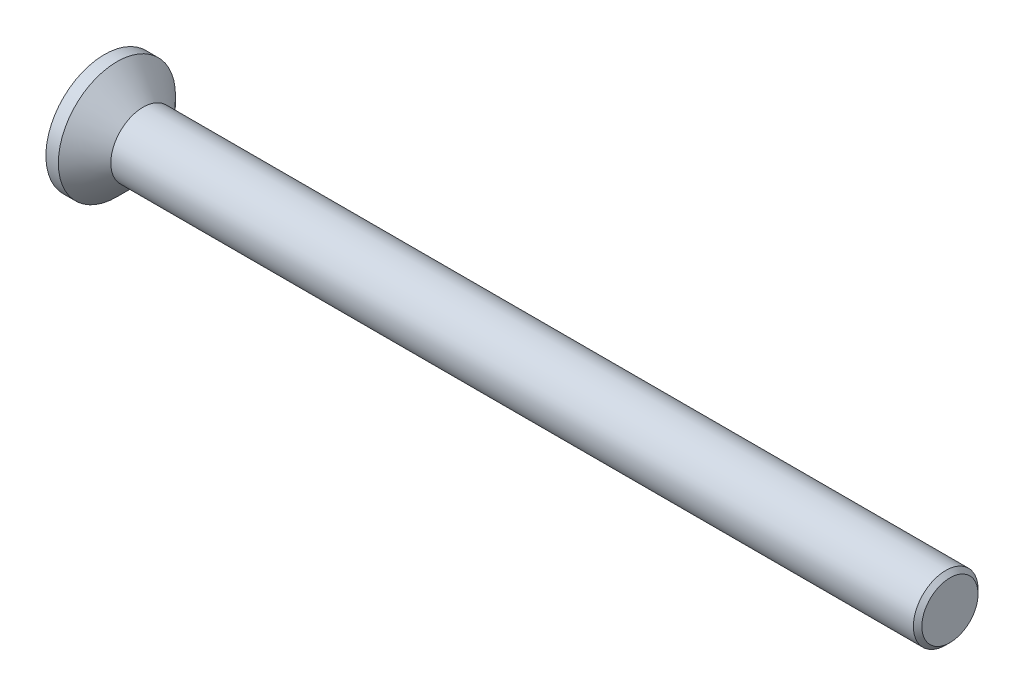
ISO-10303-21;
HEADER;
FILE_DESCRIPTION(('STEP AP214'),'2;1');
FILE_NAME('part.step','',(''),(''),'','','');
FILE_SCHEMA(('AUTOMOTIVE_DESIGN { 1 0 10303 214 1 1 1 1 }'));
ENDSEC;
DATA;
#1=APPLICATION_CONTEXT('core data for automotive mechanical design processes');
#2=APPLICATION_PROTOCOL_DEFINITION('international standard','automotive_design',2000,#1);
#3=PRODUCT_CONTEXT('',#1,'mechanical');
#4=PRODUCT('Part','Part','',(#3));
#5=PRODUCT_RELATED_PRODUCT_CATEGORY('part','',(#4));
#6=PRODUCT_DEFINITION_FORMATION('','',#4);
#7=PRODUCT_DEFINITION_CONTEXT('part definition',#1,'design');
#8=PRODUCT_DEFINITION('design','',#6,#7);
#9=PRODUCT_DEFINITION_SHAPE('','',#8);
#10=(LENGTH_UNIT() NAMED_UNIT(*) SI_UNIT(.MILLI.,.METRE.));
#11=(NAMED_UNIT(*) PLANE_ANGLE_UNIT() SI_UNIT($,.RADIAN.));
#12=(NAMED_UNIT(*) SI_UNIT($,.STERADIAN.) SOLID_ANGLE_UNIT());
#13=UNCERTAINTY_MEASURE_WITH_UNIT(LENGTH_MEASURE(1.E-05),#10,'distance_accuracy_value','');
#14=(GEOMETRIC_REPRESENTATION_CONTEXT(3) GLOBAL_UNCERTAINTY_ASSIGNED_CONTEXT((#13)) GLOBAL_UNIT_ASSIGNED_CONTEXT((#10,
#11,#12)) REPRESENTATION_CONTEXT('',''));
#15=CARTESIAN_POINT('',(0.,0.,0.));
#16=DIRECTION('',(0.,0.,1.));
#17=DIRECTION('',(1.,0.,0.));
#18=AXIS2_PLACEMENT_3D('',#15,#16,#17);
#19=CARTESIAN_POINT('',(1.09999999999999,0.,0.));
#20=DIRECTION('',(-1.,0.,0.));
#21=DIRECTION('',(0.,0.,1.));
#22=AXIS2_PLACEMENT_3D('',#19,#20,#21);
#23=CONICAL_SURFACE('',#22,0.99999999999989,1.04719755119658);
#24=CARTESIAN_POINT('',(1.67735026918958,0.,0.));
#25=VERTEX_POINT('',#24);
#26=VERTEX_LOOP('',#25);
#27=FACE_BOUND('',#26,.T.);
#28=CARTESIAN_POINT('',(1.09999999999999,0.,0.));
#29=DIRECTION('',(-1.,0.,0.));
#30=DIRECTION('',(0.,0.,1.));
#31=AXIS2_PLACEMENT_3D('',#28,#29,#30);
#32=CIRCLE('',#31,0.99999999999989);
#33=CARTESIAN_POINT('',(1.09999999999999,-0.499999999999972,0.86602540378439));
#34=VERTEX_POINT('',#33);
#35=CARTESIAN_POINT('',(1.09999999999999,0.499999999999972,0.866025403784391));
#36=VERTEX_POINT('',#35);
#37=EDGE_CURVE('E91',#34,#36,#32,.T.);
#38=ORIENTED_EDGE('',*,*,#37,.T.);
#39=CARTESIAN_POINT('',(1.09999999999999,0.,0.));
#40=DIRECTION('',(-1.,0.,0.));
#41=DIRECTION('',(0.,0.,1.));
#42=AXIS2_PLACEMENT_3D('',#39,#40,#41);
#43=CIRCLE('',#42,0.99999999999989);
#44=CARTESIAN_POINT('',(1.09999999999999,0.999999999999945,0.));
#45=VERTEX_POINT('',#44);
#46=EDGE_CURVE('E105',#36,#45,#43,.T.);
#47=ORIENTED_EDGE('',*,*,#46,.T.);
#48=CARTESIAN_POINT('',(1.09999999999999,0.,0.));
#49=DIRECTION('',(-1.,0.,0.));
#50=DIRECTION('',(0.,0.,1.));
#51=AXIS2_PLACEMENT_3D('',#48,#49,#50);
#52=CIRCLE('',#51,0.99999999999989);
#53=CARTESIAN_POINT('',(1.09999999999999,0.499999999999972,-0.866025403784391));
#54=VERTEX_POINT('',#53);
#55=EDGE_CURVE('E148',#45,#54,#52,.T.);
#56=ORIENTED_EDGE('',*,*,#55,.T.);
#57=CARTESIAN_POINT('',(1.09999999999999,0.,0.));
#58=DIRECTION('',(-1.,0.,0.));
#59=DIRECTION('',(0.,0.,1.));
#60=AXIS2_PLACEMENT_3D('',#57,#58,#59);
#61=CIRCLE('',#60,0.99999999999989);
#62=CARTESIAN_POINT('',(1.09999999999999,-0.499999999999973,-0.866025403784392));
#63=VERTEX_POINT('',#62);
#64=EDGE_CURVE('E135',#54,#63,#61,.T.);
#65=ORIENTED_EDGE('',*,*,#64,.T.);
#66=CARTESIAN_POINT('',(1.09999999999999,0.,0.));
#67=DIRECTION('',(-1.,0.,0.));
#68=DIRECTION('',(0.,0.,1.));
#69=AXIS2_PLACEMENT_3D('',#66,#67,#68);
#70=CIRCLE('',#69,0.99999999999989);
#71=CARTESIAN_POINT('',(1.09999999999999,-0.999999999999945,0.));
#72=VERTEX_POINT('',#71);
#73=EDGE_CURVE('E88',#63,#72,#70,.T.);
#74=ORIENTED_EDGE('',*,*,#73,.T.);
#75=CARTESIAN_POINT('',(1.09999999999999,0.,0.));
#76=DIRECTION('',(-1.,0.,0.));
#77=DIRECTION('',(0.,0.,1.));
#78=AXIS2_PLACEMENT_3D('',#75,#76,#77);
#79=CIRCLE('',#78,0.99999999999989);
#80=EDGE_CURVE('E19',#72,#34,#79,.T.);
#81=ORIENTED_EDGE('',*,*,#80,.T.);
#82=EDGE_LOOP('',(#38,#47,#56,#65,#74,#81));
#83=FACE_BOUND('',#82,.T.);
#84=ADVANCED_FACE('F16',(#27,#83),#23,.F.);
#85=CARTESIAN_POINT('',(1.1,0.,-1.15470053837925));
#86=DIRECTION('',(1.,0.,0.));
#87=DIRECTION('',(0.,0.,-1.));
#88=AXIS2_PLACEMENT_3D('',#85,#86,#87);
#89=PLANE('',#88);
#90=DIRECTION('',(0.,0.,1.));
#91=VECTOR('',#90,1.);
#92=CARTESIAN_POINT('',(1.1,-1.,0.577350269189625));
#93=LINE('',#92,#91);
#94=CARTESIAN_POINT('',(1.1,-1.,0.577350269189624));
#95=VERTEX_POINT('',#94);
#96=EDGE_CURVE('E110',#95,#72,#93,.F.);
#97=ORIENTED_EDGE('',*,*,#96,.F.);
#98=DIRECTION('',(0.,0.866025403784439,0.5));
#99=VECTOR('',#98,1.);
#100=CARTESIAN_POINT('',(1.1,0.,1.15470053837925));
#101=LINE('',#100,#99);
#102=EDGE_CURVE('E107',#34,#95,#101,.F.);
#103=ORIENTED_EDGE('',*,*,#102,.F.);
#104=ORIENTED_EDGE('',*,*,#80,.F.);
#105=EDGE_LOOP('',(#97,#103,#104));
#106=FACE_BOUND('',#105,.T.);
#107=ADVANCED_FACE('F108',(#106),#89,.F.);
#108=CARTESIAN_POINT('',(1.1,0.,-1.15470053837925));
#109=DIRECTION('',(1.,0.,0.));
#110=DIRECTION('',(0.,0.,-1.));
#111=AXIS2_PLACEMENT_3D('',#108,#109,#110);
#112=PLANE('',#111);
#113=DIRECTION('',(0.,0.866025403784439,0.5));
#114=VECTOR('',#113,1.);
#115=CARTESIAN_POINT('',(1.1,0.,1.15470053837925));
#116=LINE('',#115,#114);
#117=CARTESIAN_POINT('',(1.1,0.,1.15470053837925));
#118=VERTEX_POINT('',#117);
#119=EDGE_CURVE('E100',#118,#34,#116,.F.);
#120=ORIENTED_EDGE('',*,*,#119,.F.);
#121=DIRECTION('',(0.,0.866025403784439,-0.5));
#122=VECTOR('',#121,1.);
#123=CARTESIAN_POINT('',(1.1,1.,0.577350269189625));
#124=LINE('',#123,#122);
#125=EDGE_CURVE('E103',#36,#118,#124,.F.);
#126=ORIENTED_EDGE('',*,*,#125,.F.);
#127=ORIENTED_EDGE('',*,*,#37,.F.);
#128=EDGE_LOOP('',(#120,#126,#127));
#129=FACE_BOUND('',#128,.T.);
#130=ADVANCED_FACE('F98',(#129),#112,.F.);
#131=CARTESIAN_POINT('',(1.1,0.,-1.15470053837925));
#132=DIRECTION('',(1.,0.,0.));
#133=DIRECTION('',(0.,0.,-1.));
#134=AXIS2_PLACEMENT_3D('',#131,#132,#133);
#135=PLANE('',#134);
#136=DIRECTION('',(0.,0.866025403784439,-0.5));
#137=VECTOR('',#136,1.);
#138=CARTESIAN_POINT('',(1.1,1.,0.577350269189625));
#139=LINE('',#138,#137);
#140=CARTESIAN_POINT('',(1.1,1.,0.577350269189625));
#141=VERTEX_POINT('',#140);
#142=EDGE_CURVE('E131',#141,#36,#139,.F.);
#143=ORIENTED_EDGE('',*,*,#142,.F.);
#144=DIRECTION('',(0.,0.,-1.));
#145=VECTOR('',#144,1.);
#146=CARTESIAN_POINT('',(1.1,1.,-0.577350269189625));
#147=LINE('',#146,#145);
#148=EDGE_CURVE('E164',#45,#141,#147,.F.);
#149=ORIENTED_EDGE('',*,*,#148,.F.);
#150=ORIENTED_EDGE('',*,*,#46,.F.);
#151=EDGE_LOOP('',(#143,#149,#150));
#152=FACE_BOUND('',#151,.T.);
#153=ADVANCED_FACE('F165',(#152),#135,.F.);
#154=CARTESIAN_POINT('',(1.1,0.,-1.15470053837925));
#155=DIRECTION('',(1.,0.,0.));
#156=DIRECTION('',(0.,0.,-1.));
#157=AXIS2_PLACEMENT_3D('',#154,#155,#156);
#158=PLANE('',#157);
#159=DIRECTION('',(0.,0.,-1.));
#160=VECTOR('',#159,1.);
#161=CARTESIAN_POINT('',(1.1,1.,-0.577350269189625));
#162=LINE('',#161,#160);
#163=CARTESIAN_POINT('',(1.1,1.,-0.577350269189625));
#164=VERTEX_POINT('',#163);
#165=EDGE_CURVE('E158',#164,#45,#162,.F.);
#166=ORIENTED_EDGE('',*,*,#165,.F.);
#167=DIRECTION('',(0.,-0.866025403784439,-0.5));
#168=VECTOR('',#167,1.);
#169=CARTESIAN_POINT('',(1.1,0.,-1.15470053837925));
#170=LINE('',#169,#168);
#171=EDGE_CURVE('E161',#54,#164,#170,.F.);
#172=ORIENTED_EDGE('',*,*,#171,.F.);
#173=ORIENTED_EDGE('',*,*,#55,.F.);
#174=EDGE_LOOP('',(#166,#172,#173));
#175=FACE_BOUND('',#174,.T.);
#176=ADVANCED_FACE('F156',(#175),#158,.F.);
#177=CARTESIAN_POINT('',(1.1,0.,-1.15470053837925));
#178=DIRECTION('',(1.,0.,0.));
#179=DIRECTION('',(0.,0.,-1.));
#180=AXIS2_PLACEMENT_3D('',#177,#178,#179);
#181=PLANE('',#180);
#182=DIRECTION('',(0.,-0.866025403784439,0.5));
#183=VECTOR('',#182,1.);
#184=CARTESIAN_POINT('',(1.1,-1.,-0.577350269189628));
#185=LINE('',#184,#183);
#186=CARTESIAN_POINT('',(1.1,-1.,-0.577350269189628));
#187=VERTEX_POINT('',#186);
#188=EDGE_CURVE('E210',#187,#63,#185,.F.);
#189=ORIENTED_EDGE('',*,*,#188,.F.);
#190=DIRECTION('',(0.,0.,1.));
#191=VECTOR('',#190,1.);
#192=CARTESIAN_POINT('',(1.1,-1.,0.577350269189625));
#193=LINE('',#192,#191);
#194=EDGE_CURVE('E119',#72,#187,#193,.F.);
#195=ORIENTED_EDGE('',*,*,#194,.F.);
#196=ORIENTED_EDGE('',*,*,#73,.F.);
#197=EDGE_LOOP('',(#189,#195,#196));
#198=FACE_BOUND('',#197,.T.);
#199=ADVANCED_FACE('F249',(#198),#181,.F.);
#200=CARTESIAN_POINT('',(1.1,0.,-1.15470053837925));
#201=DIRECTION('',(1.,0.,0.));
#202=DIRECTION('',(0.,0.,-1.));
#203=AXIS2_PLACEMENT_3D('',#200,#201,#202);
#204=PLANE('',#203);
#205=DIRECTION('',(0.,-0.866025403784439,-0.5));
#206=VECTOR('',#205,1.);
#207=CARTESIAN_POINT('',(1.1,0.,-1.15470053837925));
#208=LINE('',#207,#206);
#209=CARTESIAN_POINT('',(1.1,0.,-1.15470053837925));
#210=VERTEX_POINT('',#209);
#211=EDGE_CURVE('E183',#210,#54,#208,.F.);
#212=ORIENTED_EDGE('',*,*,#211,.F.);
#213=DIRECTION('',(0.,-0.866025403784439,0.5));
#214=VECTOR('',#213,1.);
#215=CARTESIAN_POINT('',(1.1,-1.,-0.577350269189628));
#216=LINE('',#215,#214);
#217=EDGE_CURVE('E213',#63,#210,#216,.F.);
#218=ORIENTED_EDGE('',*,*,#217,.F.);
#219=ORIENTED_EDGE('',*,*,#64,.F.);
#220=EDGE_LOOP('',(#212,#218,#219));
#221=FACE_BOUND('',#220,.T.);
#222=ADVANCED_FACE('F246',(#221),#204,.F.);
#223=CARTESIAN_POINT('',(1.1,-1.,0.577350269189625));
#224=DIRECTION('',(0.,1.,0.));
#225=DIRECTION('',(0.,0.,1.));
#226=AXIS2_PLACEMENT_3D('',#223,#224,#225);
#227=PLANE('',#226);
#228=ORIENTED_EDGE('',*,*,#194,.T.);
#229=DIRECTION('',(1.,0.,0.));
#230=VECTOR('',#229,1.);
#231=CARTESIAN_POINT('',(1.1,-1.,-0.577350269189628));
#232=LINE('',#231,#230);
#233=CARTESIAN_POINT('',(0.,-1.,-0.577350269189628));
#234=VERTEX_POINT('',#233);
#235=EDGE_CURVE('E214',#234,#187,#232,.T.);
#236=ORIENTED_EDGE('',*,*,#235,.F.);
#237=DIRECTION('',(0.,0.,-1.));
#238=VECTOR('',#237,1.);
#239=CARTESIAN_POINT('',(0.,-1.,0.));
#240=LINE('',#239,#238);
#241=CARTESIAN_POINT('',(0.,-1.,0.577350269189625));
#242=VERTEX_POINT('',#241);
#243=EDGE_CURVE('E209',#234,#242,#240,.F.);
#244=ORIENTED_EDGE('',*,*,#243,.T.);
#245=DIRECTION('',(1.,0.,0.));
#246=VECTOR('',#245,1.);
#247=CARTESIAN_POINT('',(1.1,-1.,0.577350269189624));
#248=LINE('',#247,#246);
#249=EDGE_CURVE('E114',#95,#242,#248,.F.);
#250=ORIENTED_EDGE('',*,*,#249,.F.);
#251=ORIENTED_EDGE('',*,*,#96,.T.);
#252=EDGE_LOOP('',(#228,#236,#244,#250,#251));
#253=FACE_BOUND('',#252,.T.);
#254=ADVANCED_FACE('F251',(#253),#227,.T.);
#255=CARTESIAN_POINT('',(1.1,0.,1.15470053837925));
#256=DIRECTION('',(0.,0.5,-0.866025403784439));
#257=DIRECTION('',(0.,0.866025403784439,0.5));
#258=AXIS2_PLACEMENT_3D('',#255,#256,#257);
#259=PLANE('',#258);
#260=ORIENTED_EDGE('',*,*,#102,.T.);
#261=ORIENTED_EDGE('',*,*,#249,.T.);
#262=DIRECTION('',(0.,0.866025403784439,0.499999999999999));
#263=VECTOR('',#262,1.);
#264=CARTESIAN_POINT('',(0.,-1.,0.577350269189625));
#265=LINE('',#264,#263);
#266=CARTESIAN_POINT('',(0.,0.,1.15470053837925));
#267=VERTEX_POINT('',#266);
#268=EDGE_CURVE('E204',#242,#267,#265,.T.);
#269=ORIENTED_EDGE('',*,*,#268,.T.);
#270=DIRECTION('',(1.,0.,0.));
#271=VECTOR('',#270,1.);
#272=CARTESIAN_POINT('',(1.1,0.,1.15470053837925));
#273=LINE('',#272,#271);
#274=EDGE_CURVE('E118',#118,#267,#273,.F.);
#275=ORIENTED_EDGE('',*,*,#274,.F.);
#276=ORIENTED_EDGE('',*,*,#119,.T.);
#277=EDGE_LOOP('',(#260,#261,#269,#275,#276));
#278=FACE_BOUND('',#277,.T.);
#279=ADVANCED_FACE('F116',(#278),#259,.T.);
#280=CARTESIAN_POINT('',(1.1,1.,0.577350269189625));
#281=DIRECTION('',(0.,-0.5,-0.866025403784439));
#282=DIRECTION('',(0.,0.866025403784439,-0.5));
#283=AXIS2_PLACEMENT_3D('',#280,#281,#282);
#284=PLANE('',#283);
#285=ORIENTED_EDGE('',*,*,#125,.T.);
#286=ORIENTED_EDGE('',*,*,#274,.T.);
#287=DIRECTION('',(0.,0.866025403784439,-0.5));
#288=VECTOR('',#287,1.);
#289=CARTESIAN_POINT('',(0.,0.,1.15470053837925));
#290=LINE('',#289,#288);
#291=CARTESIAN_POINT('',(0.,1.,0.577350269189625));
#292=VERTEX_POINT('',#291);
#293=EDGE_CURVE('E194',#267,#292,#290,.T.);
#294=ORIENTED_EDGE('',*,*,#293,.T.);
#295=DIRECTION('',(1.,0.,0.));
#296=VECTOR('',#295,1.);
#297=CARTESIAN_POINT('',(1.1,1.,0.577350269189625));
#298=LINE('',#297,#296);
#299=EDGE_CURVE('E169',#141,#292,#298,.F.);
#300=ORIENTED_EDGE('',*,*,#299,.F.);
#301=ORIENTED_EDGE('',*,*,#142,.T.);
#302=EDGE_LOOP('',(#285,#286,#294,#300,#301));
#303=FACE_BOUND('',#302,.T.);
#304=ADVANCED_FACE('F192',(#303),#284,.T.);
#305=CARTESIAN_POINT('',(1.1,1.,-0.577350269189625));
#306=DIRECTION('',(0.,-1.,0.));
#307=DIRECTION('',(0.,0.,-1.));
#308=AXIS2_PLACEMENT_3D('',#305,#306,#307);
#309=PLANE('',#308);
#310=ORIENTED_EDGE('',*,*,#148,.T.);
#311=ORIENTED_EDGE('',*,*,#299,.T.);
#312=DIRECTION('',(0.,0.,-1.));
#313=VECTOR('',#312,1.);
#314=CARTESIAN_POINT('',(0.,1.,0.));
#315=LINE('',#314,#313);
#316=CARTESIAN_POINT('',(0.,1.,-0.577350269189625));
#317=VERTEX_POINT('',#316);
#318=EDGE_CURVE('E196',#292,#317,#315,.T.);
#319=ORIENTED_EDGE('',*,*,#318,.T.);
#320=DIRECTION('',(1.,0.,0.));
#321=VECTOR('',#320,1.);
#322=CARTESIAN_POINT('',(1.1,1.,-0.577350269189626));
#323=LINE('',#322,#321);
#324=EDGE_CURVE('E172',#164,#317,#323,.F.);
#325=ORIENTED_EDGE('',*,*,#324,.F.);
#326=ORIENTED_EDGE('',*,*,#165,.T.);
#327=EDGE_LOOP('',(#310,#311,#319,#325,#326));
#328=FACE_BOUND('',#327,.T.);
#329=ADVANCED_FACE('F171',(#328),#309,.T.);
#330=CARTESIAN_POINT('',(1.1,0.,-1.15470053837925));
#331=DIRECTION('',(0.,-0.5,0.866025403784439));
#332=DIRECTION('',(0.,-0.866025403784439,-0.5));
#333=AXIS2_PLACEMENT_3D('',#330,#331,#332);
#334=PLANE('',#333);
#335=ORIENTED_EDGE('',*,*,#171,.T.);
#336=ORIENTED_EDGE('',*,*,#324,.T.);
#337=DIRECTION('',(0.,-0.866025403784438,-0.5));
#338=VECTOR('',#337,1.);
#339=CARTESIAN_POINT('',(0.,1.,-0.577350269189625));
#340=LINE('',#339,#338);
#341=CARTESIAN_POINT('',(0.,0.,-1.15470053837925));
#342=VERTEX_POINT('',#341);
#343=EDGE_CURVE('E34',#317,#342,#340,.T.);
#344=ORIENTED_EDGE('',*,*,#343,.T.);
#345=DIRECTION('',(1.,0.,0.));
#346=VECTOR('',#345,1.);
#347=CARTESIAN_POINT('',(1.1,0.,-1.15470053837925));
#348=LINE('',#347,#346);
#349=EDGE_CURVE('E219',#210,#342,#348,.F.);
#350=ORIENTED_EDGE('',*,*,#349,.F.);
#351=ORIENTED_EDGE('',*,*,#211,.T.);
#352=EDGE_LOOP('',(#335,#336,#344,#350,#351));
#353=FACE_BOUND('',#352,.T.);
#354=ADVANCED_FACE('F243',(#353),#334,.T.);
#355=CARTESIAN_POINT('',(1.1,-1.,-0.577350269189628));
#356=DIRECTION('',(0.,0.5,0.866025403784439));
#357=DIRECTION('',(0.,-0.866025403784439,0.5));
#358=AXIS2_PLACEMENT_3D('',#355,#356,#357);
#359=PLANE('',#358);
#360=ORIENTED_EDGE('',*,*,#217,.T.);
#361=ORIENTED_EDGE('',*,*,#349,.T.);
#362=DIRECTION('',(0.,-0.866025403784439,0.5));
#363=VECTOR('',#362,1.);
#364=CARTESIAN_POINT('',(0.,0.,-1.15470053837925));
#365=LINE('',#364,#363);
#366=EDGE_CURVE('E145',#342,#234,#365,.T.);
#367=ORIENTED_EDGE('',*,*,#366,.T.);
#368=ORIENTED_EDGE('',*,*,#235,.T.);
#369=ORIENTED_EDGE('',*,*,#188,.T.);
#370=EDGE_LOOP('',(#360,#361,#367,#368,#369));
#371=FACE_BOUND('',#370,.T.);
#372=ADVANCED_FACE('F254',(#371),#359,.T.);
#373=CARTESIAN_POINT('',(0.,0.,0.));
#374=DIRECTION('',(1.,0.,0.));
#375=DIRECTION('',(0.,0.,-1.));
#376=AXIS2_PLACEMENT_3D('',#373,#374,#375);
#377=PLANE('',#376);
#378=ORIENTED_EDGE('',*,*,#343,.F.);
#379=ORIENTED_EDGE('',*,*,#318,.F.);
#380=ORIENTED_EDGE('',*,*,#293,.F.);
#381=ORIENTED_EDGE('',*,*,#268,.F.);
#382=ORIENTED_EDGE('',*,*,#243,.F.);
#383=ORIENTED_EDGE('',*,*,#366,.F.);
#384=EDGE_LOOP('',(#378,#379,#380,#381,#382,#383));
#385=FACE_BOUND('',#384,.T.);
#386=CARTESIAN_POINT('',(0.,0.,0.));
#387=DIRECTION('',(1.,0.,0.));
#388=DIRECTION('',(0.,0.,-1.));
#389=AXIS2_PLACEMENT_3D('',#386,#387,#388);
#390=CIRCLE('',#389,2.77);
#391=CARTESIAN_POINT('',(0.,0.,-2.77));
#392=VERTEX_POINT('',#391);
#393=EDGE_CURVE('E142',#392,#392,#390,.T.);
#394=ORIENTED_EDGE('',*,*,#393,.F.);
#395=EDGE_LOOP('',(#394));
#396=FACE_BOUND('',#395,.T.);
#397=ADVANCED_FACE('F198',(#385,#396),#377,.F.);
#398=CARTESIAN_POINT('',(40.0007106781187,0.,0.));
#399=DIRECTION('',(-1.,0.,0.));
#400=DIRECTION('',(0.,0.,1.));
#401=AXIS2_PLACEMENT_3D('',#398,#399,#400);
#402=PLANE('',#401);
#403=CARTESIAN_POINT('',(40.0007106781004,0.,0.));
#404=DIRECTION('',(-1.,0.,0.));
#405=DIRECTION('',(0.,0.,1.));
#406=AXIS2_PLACEMENT_3D('',#403,#404,#405);
#407=CIRCLE('',#406,1.32928932180221);
#408=CARTESIAN_POINT('',(40.0007106781004,0.,1.32928932180221));
#409=VERTEX_POINT('',#408);
#410=EDGE_CURVE('E138',#409,#409,#407,.T.);
#411=ORIENTED_EDGE('',*,*,#410,.F.);
#412=EDGE_LOOP('',(#411));
#413=FACE_BOUND('',#412,.T.);
#414=ADVANCED_FACE('F262',(#413),#402,.F.);
#415=CARTESIAN_POINT('',(11.8531386861314,0.,0.));
#416=DIRECTION('',(1.,0.,0.));
#417=DIRECTION('',(0.,0.,-1.));
#418=AXIS2_PLACEMENT_3D('',#415,#416,#417);
#419=CYLINDRICAL_SURFACE('',#418,2.77);
#420=CARTESIAN_POINT('',(0.589999999988322,0.,0.));
#421=DIRECTION('',(-1.,0.,0.));
#422=DIRECTION('',(0.,0.,-1.));
#423=AXIS2_PLACEMENT_3D('',#420,#421,#422);
#424=CIRCLE('',#423,2.77000000005501);
#425=CARTESIAN_POINT('',(0.589999999988322,0.,-2.77000000005501));
#426=VERTEX_POINT('',#425);
#427=EDGE_CURVE('E141',#426,#426,#424,.F.);
#428=ORIENTED_EDGE('',*,*,#427,.F.);
#429=EDGE_LOOP('',(#428));
#430=FACE_BOUND('',#429,.T.);
#431=ORIENTED_EDGE('',*,*,#393,.T.);
#432=EDGE_LOOP('',(#431));
#433=FACE_BOUND('',#432,.T.);
#434=ADVANCED_FACE('F280',(#430,#433),#419,.T.);
#435=CARTESIAN_POINT('',(39.8007106781506,0.,0.));
#436=DIRECTION('',(-1.,0.,0.));
#437=DIRECTION('',(0.,0.,1.));
#438=AXIS2_PLACEMENT_3D('',#435,#436,#437);
#439=CONICAL_SURFACE('',#438,1.52928932180885,0.785398163539557);
#440=CARTESIAN_POINT('',(39.8007106781186,0.,0.));
#441=DIRECTION('',(-1.,0.,0.));
#442=DIRECTION('',(0.,0.,1.));
#443=AXIS2_PLACEMENT_3D('',#440,#441,#442);
#444=CIRCLE('',#443,1.52928932188135);
#445=CARTESIAN_POINT('',(39.8007106781186,0.,1.52928932188135));
#446=VERTEX_POINT('',#445);
#447=EDGE_CURVE('E25',#446,#446,#444,.T.);
#448=ORIENTED_EDGE('',*,*,#447,.F.);
#449=EDGE_LOOP('',(#448));
#450=FACE_BOUND('',#449,.T.);
#451=ORIENTED_EDGE('',*,*,#410,.T.);
#452=EDGE_LOOP('',(#451));
#453=FACE_BOUND('',#452,.T.);
#454=ADVANCED_FACE('F273',(#450,#453),#439,.T.);
#455=CARTESIAN_POINT('',(0.589999999931479,0.,0.));
#456=DIRECTION('',(-1.,0.,0.));
#457=DIRECTION('',(0.,0.,1.));
#458=AXIS2_PLACEMENT_3D('',#455,#456,#457);
#459=CONICAL_SURFACE('',#458,2.77000000011185,0.785398163397448);
#460=ORIENTED_EDGE('',*,*,#427,.T.);
#461=EDGE_LOOP('',(#460));
#462=FACE_BOUND('',#461,.T.);
#463=CARTESIAN_POINT('',(1.83071067811866,0.,0.));
#464=DIRECTION('',(-1.,0.,0.));
#465=DIRECTION('',(0.,0.,1.));
#466=AXIS2_PLACEMENT_3D('',#463,#464,#465);
#467=CIRCLE('',#466,1.52928932188135);
#468=CARTESIAN_POINT('',(1.83071067811866,0.,1.52928932188135));
#469=VERTEX_POINT('',#468);
#470=EDGE_CURVE('E11',#469,#469,#467,.F.);
#471=ORIENTED_EDGE('',*,*,#470,.F.);
#472=EDGE_LOOP('',(#471));
#473=FACE_BOUND('',#472,.T.);
#474=ADVANCED_FACE('F267',(#462,#473),#459,.T.);
#475=CARTESIAN_POINT('',(10.0007106781187,0.,0.));
#476=DIRECTION('',(-1.,0.,0.));
#477=DIRECTION('',(0.,0.,1.));
#478=AXIS2_PLACEMENT_3D('',#475,#476,#477);
#479=CYLINDRICAL_SURFACE('',#478,1.52928932188135);
#480=ORIENTED_EDGE('',*,*,#470,.T.);
#481=EDGE_LOOP('',(#480));
#482=FACE_BOUND('',#481,.T.);
#483=ORIENTED_EDGE('',*,*,#447,.T.);
#484=EDGE_LOOP('',(#483));
#485=FACE_BOUND('',#484,.T.);
#486=ADVANCED_FACE('F265',(#482,#485),#479,.T.);
#487=CLOSED_SHELL('',(#84,#107,#130,#153,#176,#199,#222,#254,#279,#304,#329,#354,#372,#397,#414,
#434,#454,#474,#486));
#488=MANIFOLD_SOLID_BREP('B1',#487);
#489=ADVANCED_BREP_SHAPE_REPRESENTATION('',(#18,#488),#14);
#490=SHAPE_DEFINITION_REPRESENTATION(#9,#489);
ENDSEC;
END-ISO-10303-21;
